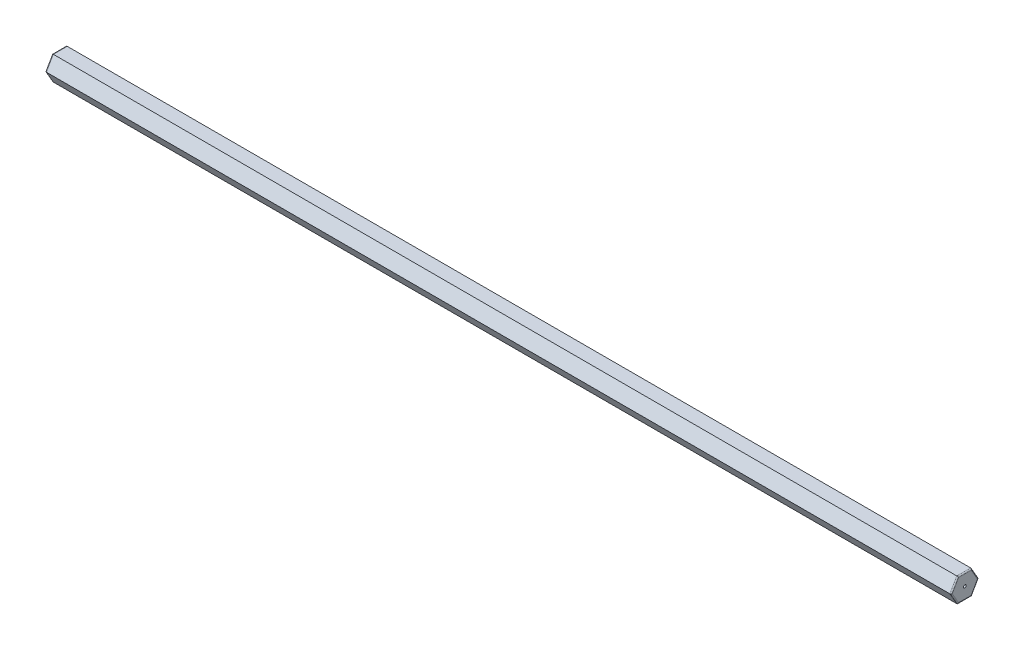
ISO-10303-21;
HEADER;
FILE_DESCRIPTION(('STEP AP214'),'2;1');
FILE_NAME('part.step','',(''),(''),'','','');
FILE_SCHEMA(('AUTOMOTIVE_DESIGN { 1 0 10303 214 1 1 1 1 }'));
ENDSEC;
DATA;
#1=APPLICATION_CONTEXT('core data for automotive mechanical design processes');
#2=APPLICATION_PROTOCOL_DEFINITION('international standard','automotive_design',2000,#1);
#3=PRODUCT_CONTEXT('',#1,'mechanical');
#4=PRODUCT('Part','Part','',(#3));
#5=PRODUCT_RELATED_PRODUCT_CATEGORY('part','',(#4));
#6=PRODUCT_DEFINITION_FORMATION('','',#4);
#7=PRODUCT_DEFINITION_CONTEXT('part definition',#1,'design');
#8=PRODUCT_DEFINITION('design','',#6,#7);
#9=PRODUCT_DEFINITION_SHAPE('','',#8);
#10=(LENGTH_UNIT() NAMED_UNIT(*) SI_UNIT(.MILLI.,.METRE.));
#11=(NAMED_UNIT(*) PLANE_ANGLE_UNIT() SI_UNIT($,.RADIAN.));
#12=(NAMED_UNIT(*) SI_UNIT($,.STERADIAN.) SOLID_ANGLE_UNIT());
#13=UNCERTAINTY_MEASURE_WITH_UNIT(LENGTH_MEASURE(1.E-05),#10,'distance_accuracy_value','');
#14=(GEOMETRIC_REPRESENTATION_CONTEXT(3) GLOBAL_UNCERTAINTY_ASSIGNED_CONTEXT((#13)) GLOBAL_UNIT_ASSIGNED_CONTEXT((#10,
#11,#12)) REPRESENTATION_CONTEXT('',''));
#15=CARTESIAN_POINT('',(0.,0.,0.));
#16=DIRECTION('',(0.,0.,1.));
#17=DIRECTION('',(1.,0.,0.));
#18=AXIS2_PLACEMENT_3D('',#15,#16,#17);
#19=CARTESIAN_POINT('',(-100.4824,-1.3335,-0.76989658396437));
#20=DIRECTION('',(0.,-0.5,-0.866025403784439));
#21=DIRECTION('',(0.,0.866025403784439,-0.5));
#22=AXIS2_PLACEMENT_3D('',#19,#20,#21);
#23=PLANE('',#22);
#24=DIRECTION('',(1.,0.,0.));
#25=VECTOR('',#24,1.);
#26=CARTESIAN_POINT('',(-100.4824,-1.3335,-0.76989658396437));
#27=LINE('',#26,#25);
#28=CARTESIAN_POINT('',(-100.3554,-1.3335,-0.76989658396437));
#29=VERTEX_POINT('',#28);
#30=CARTESIAN_POINT('',(-0.126999999999988,-1.3335,-0.76989658396437));
#31=VERTEX_POINT('',#30);
#32=EDGE_CURVE('E152',#29,#31,#27,.T.);
#33=ORIENTED_EDGE('',*,*,#32,.F.);
#34=DIRECTION('',(0.,0.866025403784439,-0.5));
#35=VECTOR('',#34,1.);
#36=CARTESIAN_POINT('',(-100.3554,0.,-1.53979316792873));
#37=LINE('',#36,#35);
#38=CARTESIAN_POINT('',(-100.3554,0.,-1.53979316792873));
#39=VERTEX_POINT('',#38);
#40=EDGE_CURVE('E184',#29,#39,#37,.T.);
#41=ORIENTED_EDGE('',*,*,#40,.T.);
#42=DIRECTION('',(1.,0.,0.));
#43=VECTOR('',#42,1.);
#44=CARTESIAN_POINT('',(-100.4824,0.,-1.53979316792873));
#45=LINE('',#44,#43);
#46=CARTESIAN_POINT('',(-0.126999999999988,0.,-1.53979316792873));
#47=VERTEX_POINT('',#46);
#48=EDGE_CURVE('E218',#39,#47,#45,.T.);
#49=ORIENTED_EDGE('',*,*,#48,.T.);
#50=DIRECTION('',(0.,0.866025403784439,-0.5));
#51=VECTOR('',#50,1.);
#52=CARTESIAN_POINT('',(-0.127000000000002,-1.3335,-0.76989658396437));
#53=LINE('',#52,#51);
#54=EDGE_CURVE('E182',#47,#31,#53,.F.);
#55=ORIENTED_EDGE('',*,*,#54,.T.);
#56=EDGE_LOOP('',(#33,#41,#49,#55));
#57=FACE_BOUND('',#56,.T.);
#58=ADVANCED_FACE('F37',(#57),#23,.T.);
#59=CARTESIAN_POINT('',(-100.4824,-1.3335,0.769896583964367));
#60=DIRECTION('',(0.,-1.,0.));
#61=DIRECTION('',(0.,0.,-1.));
#62=AXIS2_PLACEMENT_3D('',#59,#60,#61);
#63=PLANE('',#62);
#64=DIRECTION('',(1.,0.,0.));
#65=VECTOR('',#64,1.);
#66=CARTESIAN_POINT('',(-100.4824,-1.3335,0.769896583964367));
#67=LINE('',#66,#65);
#68=CARTESIAN_POINT('',(-100.3554,-1.3335,0.769896583964367));
#69=VERTEX_POINT('',#68);
#70=CARTESIAN_POINT('',(-0.126999999999988,-1.3335,0.769896583964367));
#71=VERTEX_POINT('',#70);
#72=EDGE_CURVE('E133',#69,#71,#67,.T.);
#73=ORIENTED_EDGE('',*,*,#72,.F.);
#74=DIRECTION('',(0.,0.,-1.));
#75=VECTOR('',#74,1.);
#76=CARTESIAN_POINT('',(-100.3554,-1.3335,-0.76989658396437));
#77=LINE('',#76,#75);
#78=EDGE_CURVE('E148',#69,#29,#77,.T.);
#79=ORIENTED_EDGE('',*,*,#78,.T.);
#80=ORIENTED_EDGE('',*,*,#32,.T.);
#81=DIRECTION('',(0.,0.,-1.));
#82=VECTOR('',#81,1.);
#83=CARTESIAN_POINT('',(-0.127000000000002,-1.3335,0.769896583964367));
#84=LINE('',#83,#82);
#85=EDGE_CURVE('E151',#31,#71,#84,.F.);
#86=ORIENTED_EDGE('',*,*,#85,.T.);
#87=EDGE_LOOP('',(#73,#79,#80,#86));
#88=FACE_BOUND('',#87,.T.);
#89=ADVANCED_FACE('F145',(#88),#63,.T.);
#90=CARTESIAN_POINT('',(-100.4824,0.,1.53979316792873));
#91=DIRECTION('',(0.,-0.5,0.866025403784439));
#92=DIRECTION('',(0.,-0.866025403784439,-0.5));
#93=AXIS2_PLACEMENT_3D('',#90,#91,#92);
#94=PLANE('',#93);
#95=DIRECTION('',(1.,0.,0.));
#96=VECTOR('',#95,1.);
#97=CARTESIAN_POINT('',(-100.4824,0.,1.53979316792873));
#98=LINE('',#97,#96);
#99=CARTESIAN_POINT('',(-100.3554,0.,1.53979316792873));
#100=VERTEX_POINT('',#99);
#101=CARTESIAN_POINT('',(-0.126999999999988,0.,1.53979316792873));
#102=VERTEX_POINT('',#101);
#103=EDGE_CURVE('E135',#100,#102,#98,.T.);
#104=ORIENTED_EDGE('',*,*,#103,.F.);
#105=DIRECTION('',(0.,-0.866025403784439,-0.5));
#106=VECTOR('',#105,1.);
#107=CARTESIAN_POINT('',(-100.3554,-1.3335,0.769896583964367));
#108=LINE('',#107,#106);
#109=EDGE_CURVE('E129',#100,#69,#108,.T.);
#110=ORIENTED_EDGE('',*,*,#109,.T.);
#111=ORIENTED_EDGE('',*,*,#72,.T.);
#112=DIRECTION('',(0.,-0.866025403784439,-0.5));
#113=VECTOR('',#112,1.);
#114=CARTESIAN_POINT('',(-0.127000000000002,0.,1.53979316792873));
#115=LINE('',#114,#113);
#116=EDGE_CURVE('E141',#71,#102,#115,.F.);
#117=ORIENTED_EDGE('',*,*,#116,.T.);
#118=EDGE_LOOP('',(#104,#110,#111,#117));
#119=FACE_BOUND('',#118,.T.);
#120=ADVANCED_FACE('F131',(#119),#94,.T.);
#121=CARTESIAN_POINT('',(-100.4824,1.3335,0.769896583964367));
#122=DIRECTION('',(0.,0.5,0.866025403784438));
#123=DIRECTION('',(0.,-0.866025403784439,0.5));
#124=AXIS2_PLACEMENT_3D('',#121,#122,#123);
#125=PLANE('',#124);
#126=DIRECTION('',(1.,0.,0.));
#127=VECTOR('',#126,1.);
#128=CARTESIAN_POINT('',(-100.4824,1.3335,0.769896583964367));
#129=LINE('',#128,#127);
#130=CARTESIAN_POINT('',(-100.3554,1.3335,0.769896583964367));
#131=VERTEX_POINT('',#130);
#132=CARTESIAN_POINT('',(-0.126999999999988,1.3335,0.769896583964367));
#133=VERTEX_POINT('',#132);
#134=EDGE_CURVE('E252',#131,#133,#129,.T.);
#135=ORIENTED_EDGE('',*,*,#134,.F.);
#136=DIRECTION('',(0.,-0.866025403784439,0.5));
#137=VECTOR('',#136,1.);
#138=CARTESIAN_POINT('',(-100.3554,0.,1.53979316792873));
#139=LINE('',#138,#137);
#140=EDGE_CURVE('E196',#131,#100,#139,.T.);
#141=ORIENTED_EDGE('',*,*,#140,.T.);
#142=ORIENTED_EDGE('',*,*,#103,.T.);
#143=DIRECTION('',(0.,-0.866025403784439,0.5));
#144=VECTOR('',#143,1.);
#145=CARTESIAN_POINT('',(-0.127000000000002,1.3335,0.769896583964367));
#146=LINE('',#145,#144);
#147=EDGE_CURVE('E194',#102,#133,#146,.F.);
#148=ORIENTED_EDGE('',*,*,#147,.T.);
#149=EDGE_LOOP('',(#135,#141,#142,#148));
#150=FACE_BOUND('',#149,.T.);
#151=ADVANCED_FACE('F334',(#150),#125,.T.);
#152=CARTESIAN_POINT('',(-100.4824,1.3335,-0.769896583964363));
#153=DIRECTION('',(0.,1.,0.));
#154=DIRECTION('',(0.,0.,1.));
#155=AXIS2_PLACEMENT_3D('',#152,#153,#154);
#156=PLANE('',#155);
#157=DIRECTION('',(1.,0.,0.));
#158=VECTOR('',#157,1.);
#159=CARTESIAN_POINT('',(-100.4824,1.3335,-0.769896583964363));
#160=LINE('',#159,#158);
#161=CARTESIAN_POINT('',(-100.3554,1.3335,-0.769896583964363));
#162=VERTEX_POINT('',#161);
#163=CARTESIAN_POINT('',(-0.126999999999988,1.3335,-0.769896583964363));
#164=VERTEX_POINT('',#163);
#165=EDGE_CURVE('E250',#162,#164,#160,.T.);
#166=ORIENTED_EDGE('',*,*,#165,.F.);
#167=DIRECTION('',(0.,0.,1.));
#168=VECTOR('',#167,1.);
#169=CARTESIAN_POINT('',(-100.3554,1.3335,0.769896583964367));
#170=LINE('',#169,#168);
#171=EDGE_CURVE('E192',#162,#131,#170,.T.);
#172=ORIENTED_EDGE('',*,*,#171,.T.);
#173=ORIENTED_EDGE('',*,*,#134,.T.);
#174=DIRECTION('',(0.,0.,1.));
#175=VECTOR('',#174,1.);
#176=CARTESIAN_POINT('',(-0.127000000000002,1.3335,-0.769896583964363));
#177=LINE('',#176,#175);
#178=EDGE_CURVE('E190',#133,#164,#177,.F.);
#179=ORIENTED_EDGE('',*,*,#178,.T.);
#180=EDGE_LOOP('',(#166,#172,#173,#179));
#181=FACE_BOUND('',#180,.T.);
#182=ADVANCED_FACE('F336',(#181),#156,.T.);
#183=CARTESIAN_POINT('',(-100.4824,0.,-1.53979316792873));
#184=DIRECTION('',(0.,0.500000000000001,-0.866025403784438));
#185=DIRECTION('',(0.,0.866025403784438,0.500000000000001));
#186=AXIS2_PLACEMENT_3D('',#183,#184,#185);
#187=PLANE('',#186);
#188=ORIENTED_EDGE('',*,*,#48,.F.);
#189=DIRECTION('',(0.,0.866025403784438,0.500000000000001));
#190=VECTOR('',#189,1.);
#191=CARTESIAN_POINT('',(-100.3554,1.3335,-0.769896583964363));
#192=LINE('',#191,#190);
#193=EDGE_CURVE('E188',#39,#162,#192,.T.);
#194=ORIENTED_EDGE('',*,*,#193,.T.);
#195=ORIENTED_EDGE('',*,*,#165,.T.);
#196=DIRECTION('',(0.,0.866025403784438,0.500000000000001));
#197=VECTOR('',#196,1.);
#198=CARTESIAN_POINT('',(-0.127000000000002,0.,-1.53979316792873));
#199=LINE('',#198,#197);
#200=EDGE_CURVE('E186',#164,#47,#199,.F.);
#201=ORIENTED_EDGE('',*,*,#200,.T.);
#202=EDGE_LOOP('',(#188,#194,#195,#201));
#203=FACE_BOUND('',#202,.T.);
#204=ADVANCED_FACE('F247',(#203),#187,.T.);
#205=CARTESIAN_POINT('',(-100.4824,0.,-1.53979316792873));
#206=DIRECTION('',(1.,0.,0.));
#207=DIRECTION('',(0.,0.,-1.));
#208=AXIS2_PLACEMENT_3D('',#205,#206,#207);
#209=PLANE('',#208);
#210=DIRECTION('',(0.,0.866025403784439,-0.5));
#211=VECTOR('',#210,1.);
#212=CARTESIAN_POINT('',(-100.4824,-1.27,-0.659911357683747));
#213=LINE('',#212,#211);
#214=CARTESIAN_POINT('',(-100.4824,0.,-1.39314619955457));
#215=VERTEX_POINT('',#214);
#216=CARTESIAN_POINT('',(-100.4824,-1.2065,-0.696573099777288));
#217=VERTEX_POINT('',#216);
#218=EDGE_CURVE('E178',#215,#217,#213,.F.);
#219=ORIENTED_EDGE('',*,*,#218,.T.);
#220=DIRECTION('',(0.,0.,-1.));
#221=VECTOR('',#220,1.);
#222=CARTESIAN_POINT('',(-100.4824,-1.2065,0.769896583964367));
#223=LINE('',#222,#221);
#224=CARTESIAN_POINT('',(-100.4824,-1.2065,0.696573099777285));
#225=VERTEX_POINT('',#224);
#226=EDGE_CURVE('E180',#217,#225,#223,.F.);
#227=ORIENTED_EDGE('',*,*,#226,.T.);
#228=DIRECTION('',(0.,-0.866025403784439,-0.5));
#229=VECTOR('',#228,1.);
#230=CARTESIAN_POINT('',(-100.4824,0.0634999999999995,1.42980794164811));
#231=LINE('',#230,#229);
#232=CARTESIAN_POINT('',(-100.4824,0.,1.39314619955457));
#233=VERTEX_POINT('',#232);
#234=EDGE_CURVE('E157',#225,#233,#231,.F.);
#235=ORIENTED_EDGE('',*,*,#234,.T.);
#236=DIRECTION('',(0.,-0.866025403784439,0.5));
#237=VECTOR('',#236,1.);
#238=CARTESIAN_POINT('',(-100.4824,1.27,0.659911357683743));
#239=LINE('',#238,#237);
#240=CARTESIAN_POINT('',(-100.4824,1.2065,0.696573099777284));
#241=VERTEX_POINT('',#240);
#242=EDGE_CURVE('E168',#233,#241,#239,.F.);
#243=ORIENTED_EDGE('',*,*,#242,.T.);
#244=DIRECTION('',(0.,0.,1.));
#245=VECTOR('',#244,1.);
#246=CARTESIAN_POINT('',(-100.4824,1.2065,-0.769896583964363));
#247=LINE('',#246,#245);
#248=CARTESIAN_POINT('',(-100.4824,1.2065,-0.696573099777281));
#249=VERTEX_POINT('',#248);
#250=EDGE_CURVE('E174',#241,#249,#247,.F.);
#251=ORIENTED_EDGE('',*,*,#250,.T.);
#252=DIRECTION('',(0.,0.866025403784438,0.500000000000001));
#253=VECTOR('',#252,1.);
#254=CARTESIAN_POINT('',(-100.4824,-0.0635000000000053,-1.42980794164811));
#255=LINE('',#254,#253);
#256=EDGE_CURVE('E176',#249,#215,#255,.F.);
#257=ORIENTED_EDGE('',*,*,#256,.T.);
#258=EDGE_LOOP('',(#219,#227,#235,#243,#251,#257));
#259=FACE_BOUND('',#258,.T.);
#260=ADVANCED_FACE('F277',(#259),#209,.F.);
#261=CARTESIAN_POINT('',(0.,0.,-1.53979316792873));
#262=DIRECTION('',(1.,0.,0.));
#263=DIRECTION('',(0.,0.,-1.));
#264=AXIS2_PLACEMENT_3D('',#261,#262,#263);
#265=PLANE('',#264);
#266=CARTESIAN_POINT('',(0.,0.,0.));
#267=DIRECTION('',(1.,0.,0.));
#268=DIRECTION('',(0.,0.,-1.));
#269=AXIS2_PLACEMENT_3D('',#266,#267,#268);
#270=CIRCLE('',#269,0.153628898890699);
#271=CARTESIAN_POINT('',(0.,0.,-0.153628898890699));
#272=VERTEX_POINT('',#271);
#273=EDGE_CURVE('E259',#272,#272,#270,.T.);
#274=ORIENTED_EDGE('',*,*,#273,.F.);
#275=EDGE_LOOP('',(#274));
#276=FACE_BOUND('',#275,.T.);
#277=DIRECTION('',(0.,-0.866025403784439,0.5));
#278=VECTOR('',#277,1.);
#279=CARTESIAN_POINT('',(0.,1.27,0.659911357683745));
#280=LINE('',#279,#278);
#281=CARTESIAN_POINT('',(0.,1.2065,0.696573099777285));
#282=VERTEX_POINT('',#281);
#283=CARTESIAN_POINT('',(0.,0.,1.39314619955457));
#284=VERTEX_POINT('',#283);
#285=EDGE_CURVE('E140',#282,#284,#280,.T.);
#286=ORIENTED_EDGE('',*,*,#285,.T.);
#287=DIRECTION('',(0.,-0.866025403784439,-0.5));
#288=VECTOR('',#287,1.);
#289=CARTESIAN_POINT('',(0.,-1.27000000000001,0.659911357683741));
#290=LINE('',#289,#288);
#291=CARTESIAN_POINT('',(0.,-1.2065,0.696573099777285));
#292=VERTEX_POINT('',#291);
#293=EDGE_CURVE('E11',#284,#292,#290,.T.);
#294=ORIENTED_EDGE('',*,*,#293,.T.);
#295=DIRECTION('',(0.,0.,-1.));
#296=VECTOR('',#295,1.);
#297=CARTESIAN_POINT('',(0.,-1.2065,-1.53979316792873));
#298=LINE('',#297,#296);
#299=CARTESIAN_POINT('',(0.,-1.2065,-0.696573099777287));
#300=VERTEX_POINT('',#299);
#301=EDGE_CURVE('E46',#292,#300,#298,.T.);
#302=ORIENTED_EDGE('',*,*,#301,.T.);
#303=DIRECTION('',(0.,0.866025403784439,-0.5));
#304=VECTOR('',#303,1.);
#305=CARTESIAN_POINT('',(0.,0.0634999999999952,-1.42980794164811));
#306=LINE('',#305,#304);
#307=CARTESIAN_POINT('',(0.,0.,-1.39314619955457));
#308=VERTEX_POINT('',#307);
#309=EDGE_CURVE('E204',#300,#308,#306,.T.);
#310=ORIENTED_EDGE('',*,*,#309,.T.);
#311=DIRECTION('',(0.,0.866025403784438,0.500000000000001));
#312=VECTOR('',#311,1.);
#313=CARTESIAN_POINT('',(0.,-0.0635000000000048,-1.42980794164811));
#314=LINE('',#313,#312);
#315=CARTESIAN_POINT('',(0.,1.2065,-0.696573099777281));
#316=VERTEX_POINT('',#315);
#317=EDGE_CURVE('E202',#308,#316,#314,.T.);
#318=ORIENTED_EDGE('',*,*,#317,.T.);
#319=DIRECTION('',(0.,0.,1.));
#320=VECTOR('',#319,1.);
#321=CARTESIAN_POINT('',(0.,1.2065,-1.53979316792873));
#322=LINE('',#321,#320);
#323=EDGE_CURVE('E200',#316,#282,#322,.T.);
#324=ORIENTED_EDGE('',*,*,#323,.T.);
#325=EDGE_LOOP('',(#286,#294,#302,#310,#318,#324));
#326=FACE_BOUND('',#325,.T.);
#327=ADVANCED_FACE('F274',(#276,#326),#265,.T.);
#328=CARTESIAN_POINT('',(-100.3554,1.2065,-0.769896583964363));
#329=DIRECTION('',(0.,0.,-1.));
#330=DIRECTION('',(-1.,0.,0.));
#331=AXIS2_PLACEMENT_3D('',#328,#329,#330);
#332=CYLINDRICAL_SURFACE('',#331,0.127);
#333=CARTESIAN_POINT('',(-100.3554,1.2065,-0.696573099777281));
#334=DIRECTION('',(0.,-0.5,-0.866025403784439));
#335=DIRECTION('',(0.,0.866025403784439,-0.5));
#336=AXIS2_PLACEMENT_3D('',#333,#334,#335);
#337=ELLIPSE('',#336,0.146646968374165,0.127);
#338=EDGE_CURVE('E212',#249,#162,#337,.T.);
#339=ORIENTED_EDGE('',*,*,#338,.F.);
#340=ORIENTED_EDGE('',*,*,#250,.F.);
#341=CARTESIAN_POINT('',(-100.3554,1.2065,0.696573099777284));
#342=DIRECTION('',(0.,0.5,-0.866025403784439));
#343=DIRECTION('',(0.,0.866025403784439,0.5));
#344=AXIS2_PLACEMENT_3D('',#341,#342,#343);
#345=ELLIPSE('',#344,0.146646968374165,0.127);
#346=EDGE_CURVE('E215',#131,#241,#345,.F.);
#347=ORIENTED_EDGE('',*,*,#346,.F.);
#348=ORIENTED_EDGE('',*,*,#171,.F.);
#349=EDGE_LOOP('',(#339,#340,#347,#348));
#350=FACE_BOUND('',#349,.T.);
#351=ADVANCED_FACE('F276',(#350),#332,.T.);
#352=CARTESIAN_POINT('',(-100.3554,1.27,0.659911357683743));
#353=DIRECTION('',(0.,0.866025403784439,-0.5));
#354=DIRECTION('',(0.,0.5,0.866025403784438));
#355=AXIS2_PLACEMENT_3D('',#352,#353,#354);
#356=CYLINDRICAL_SURFACE('',#355,0.127);
#357=ORIENTED_EDGE('',*,*,#346,.T.);
#358=ORIENTED_EDGE('',*,*,#242,.F.);
#359=CARTESIAN_POINT('',(-100.3554,0.,1.39314619955457));
#360=DIRECTION('',(0.,1.,0.));
#361=DIRECTION('',(0.,0.,1.));
#362=AXIS2_PLACEMENT_3D('',#359,#360,#361);
#363=ELLIPSE('',#362,0.146646968374165,0.127);
#364=EDGE_CURVE('E210',#100,#233,#363,.F.);
#365=ORIENTED_EDGE('',*,*,#364,.F.);
#366=ORIENTED_EDGE('',*,*,#140,.F.);
#367=EDGE_LOOP('',(#357,#358,#365,#366));
#368=FACE_BOUND('',#367,.T.);
#369=ADVANCED_FACE('F313',(#368),#356,.T.);
#370=CARTESIAN_POINT('',(-100.3554,-0.0635000000000052,-1.42980794164811));
#371=DIRECTION('',(0.,-0.866025403784438,-0.500000000000001));
#372=DIRECTION('',(0.,0.500000000000001,-0.866025403784438));
#373=AXIS2_PLACEMENT_3D('',#370,#371,#372);
#374=CYLINDRICAL_SURFACE('',#373,0.127);
#375=ORIENTED_EDGE('',*,*,#338,.T.);
#376=ORIENTED_EDGE('',*,*,#193,.F.);
#377=CARTESIAN_POINT('',(-100.3554,0.,-1.39314619955457));
#378=DIRECTION('',(0.,-1.,0.));
#379=DIRECTION('',(0.,0.,-1.));
#380=AXIS2_PLACEMENT_3D('',#377,#378,#379);
#381=ELLIPSE('',#380,0.146646968374165,0.127);
#382=EDGE_CURVE('E161',#215,#39,#381,.T.);
#383=ORIENTED_EDGE('',*,*,#382,.F.);
#384=ORIENTED_EDGE('',*,*,#256,.F.);
#385=EDGE_LOOP('',(#375,#376,#383,#384));
#386=FACE_BOUND('',#385,.T.);
#387=ADVANCED_FACE('F310',(#386),#374,.T.);
#388=CARTESIAN_POINT('',(-100.3554,0.0634999999999995,1.42980794164811));
#389=DIRECTION('',(0.,0.866025403784439,0.5));
#390=DIRECTION('',(0.,-0.5,0.866025403784439));
#391=AXIS2_PLACEMENT_3D('',#388,#389,#390);
#392=CYLINDRICAL_SURFACE('',#391,0.127);
#393=ORIENTED_EDGE('',*,*,#364,.T.);
#394=ORIENTED_EDGE('',*,*,#234,.F.);
#395=CARTESIAN_POINT('',(-100.3554,-1.2065,0.696573099777285));
#396=DIRECTION('',(0.,0.5,0.866025403784439));
#397=DIRECTION('',(0.,0.866025403784439,-0.5));
#398=AXIS2_PLACEMENT_3D('',#395,#396,#397);
#399=ELLIPSE('',#398,0.146646968374165,0.127);
#400=EDGE_CURVE('E155',#69,#225,#399,.F.);
#401=ORIENTED_EDGE('',*,*,#400,.F.);
#402=ORIENTED_EDGE('',*,*,#109,.F.);
#403=EDGE_LOOP('',(#393,#394,#401,#402));
#404=FACE_BOUND('',#403,.T.);
#405=ADVANCED_FACE('F156',(#404),#392,.T.);
#406=CARTESIAN_POINT('',(-100.3554,-1.27,-0.659911357683747));
#407=DIRECTION('',(0.,-0.866025403784439,0.5));
#408=DIRECTION('',(0.,-0.5,-0.866025403784439));
#409=AXIS2_PLACEMENT_3D('',#406,#407,#408);
#410=CYLINDRICAL_SURFACE('',#409,0.127);
#411=ORIENTED_EDGE('',*,*,#382,.T.);
#412=ORIENTED_EDGE('',*,*,#40,.F.);
#413=CARTESIAN_POINT('',(-100.3554,-1.2065,-0.696573099777288));
#414=DIRECTION('',(0.,-0.5,0.866025403784439));
#415=DIRECTION('',(0.,-0.866025403784439,-0.5));
#416=AXIS2_PLACEMENT_3D('',#413,#414,#415);
#417=ELLIPSE('',#416,0.146646968374165,0.127);
#418=EDGE_CURVE('E162',#217,#29,#417,.T.);
#419=ORIENTED_EDGE('',*,*,#418,.F.);
#420=ORIENTED_EDGE('',*,*,#218,.F.);
#421=EDGE_LOOP('',(#411,#412,#419,#420));
#422=FACE_BOUND('',#421,.T.);
#423=ADVANCED_FACE('F304',(#422),#410,.T.);
#424=CARTESIAN_POINT('',(-100.3554,-1.2065,0.769896583964367));
#425=DIRECTION('',(0.,0.,1.));
#426=DIRECTION('',(0.,-1.,0.));
#427=AXIS2_PLACEMENT_3D('',#424,#425,#426);
#428=CYLINDRICAL_SURFACE('',#427,0.127);
#429=ORIENTED_EDGE('',*,*,#400,.T.);
#430=ORIENTED_EDGE('',*,*,#226,.F.);
#431=ORIENTED_EDGE('',*,*,#418,.T.);
#432=ORIENTED_EDGE('',*,*,#78,.F.);
#433=EDGE_LOOP('',(#429,#430,#431,#432));
#434=FACE_BOUND('',#433,.T.);
#435=ADVANCED_FACE('F164',(#434),#428,.T.);
#436=CARTESIAN_POINT('',(-0.127,-0.0635000000000048,-1.42980794164811));
#437=DIRECTION('',(0.,0.866025403784438,0.500000000000001));
#438=DIRECTION('',(0.,-0.500000000000001,0.866025403784438));
#439=AXIS2_PLACEMENT_3D('',#436,#437,#438);
#440=CYLINDRICAL_SURFACE('',#439,0.127);
#441=CARTESIAN_POINT('',(-0.127,0.,-1.39314619955457));
#442=DIRECTION('',(0.,1.,0.));
#443=DIRECTION('',(0.,0.,1.));
#444=AXIS2_PLACEMENT_3D('',#441,#442,#443);
#445=ELLIPSE('',#444,0.146646968374165,0.127);
#446=EDGE_CURVE('E228',#47,#308,#445,.F.);
#447=ORIENTED_EDGE('',*,*,#446,.F.);
#448=ORIENTED_EDGE('',*,*,#200,.F.);
#449=CARTESIAN_POINT('',(-0.127,1.2065,-0.696573099777281));
#450=DIRECTION('',(0.,0.5,0.866025403784439));
#451=DIRECTION('',(0.,-0.866025403784439,0.5));
#452=AXIS2_PLACEMENT_3D('',#449,#450,#451);
#453=ELLIPSE('',#452,0.146646968374165,0.127);
#454=EDGE_CURVE('E41',#316,#164,#453,.T.);
#455=ORIENTED_EDGE('',*,*,#454,.F.);
#456=ORIENTED_EDGE('',*,*,#317,.F.);
#457=EDGE_LOOP('',(#447,#448,#455,#456));
#458=FACE_BOUND('',#457,.T.);
#459=ADVANCED_FACE('F39',(#458),#440,.T.);
#460=CARTESIAN_POINT('',(-0.127,1.2065,-1.53979316792873));
#461=DIRECTION('',(0.,0.,1.));
#462=DIRECTION('',(1.,0.,0.));
#463=AXIS2_PLACEMENT_3D('',#460,#461,#462);
#464=CYLINDRICAL_SURFACE('',#463,0.127);
#465=ORIENTED_EDGE('',*,*,#454,.T.);
#466=ORIENTED_EDGE('',*,*,#178,.F.);
#467=CARTESIAN_POINT('',(-0.127,1.2065,0.696573099777285));
#468=DIRECTION('',(0.,-0.5,0.866025403784439));
#469=DIRECTION('',(0.,-0.866025403784439,-0.5));
#470=AXIS2_PLACEMENT_3D('',#467,#468,#469);
#471=ELLIPSE('',#470,0.146646968374165,0.127);
#472=EDGE_CURVE('E226',#282,#133,#471,.T.);
#473=ORIENTED_EDGE('',*,*,#472,.F.);
#474=ORIENTED_EDGE('',*,*,#323,.F.);
#475=EDGE_LOOP('',(#465,#466,#473,#474));
#476=FACE_BOUND('',#475,.T.);
#477=ADVANCED_FACE('F238',(#476),#464,.T.);
#478=CARTESIAN_POINT('',(-0.127,0.0634999999999952,-1.42980794164811));
#479=DIRECTION('',(0.,0.866025403784439,-0.5));
#480=DIRECTION('',(0.,0.5,0.866025403784439));
#481=AXIS2_PLACEMENT_3D('',#478,#479,#480);
#482=CYLINDRICAL_SURFACE('',#481,0.127);
#483=ORIENTED_EDGE('',*,*,#446,.T.);
#484=ORIENTED_EDGE('',*,*,#309,.F.);
#485=CARTESIAN_POINT('',(-0.127,-1.2065,-0.696573099777288));
#486=DIRECTION('',(0.,0.5,-0.866025403784439));
#487=DIRECTION('',(0.,0.866025403784439,0.5));
#488=AXIS2_PLACEMENT_3D('',#485,#486,#487);
#489=ELLIPSE('',#488,0.146646968374165,0.127);
#490=EDGE_CURVE('E223',#31,#300,#489,.F.);
#491=ORIENTED_EDGE('',*,*,#490,.F.);
#492=ORIENTED_EDGE('',*,*,#54,.F.);
#493=EDGE_LOOP('',(#483,#484,#491,#492));
#494=FACE_BOUND('',#493,.T.);
#495=ADVANCED_FACE('F396',(#494),#482,.T.);
#496=CARTESIAN_POINT('',(-0.127,1.27,0.659911357683745));
#497=DIRECTION('',(0.,-0.866025403784439,0.5));
#498=DIRECTION('',(0.,-0.5,-0.866025403784438));
#499=AXIS2_PLACEMENT_3D('',#496,#497,#498);
#500=CYLINDRICAL_SURFACE('',#499,0.127);
#501=ORIENTED_EDGE('',*,*,#472,.T.);
#502=ORIENTED_EDGE('',*,*,#147,.F.);
#503=CARTESIAN_POINT('',(-0.127,0.,1.39314619955457));
#504=DIRECTION('',(0.,-1.,0.));
#505=DIRECTION('',(0.,0.,1.));
#506=AXIS2_PLACEMENT_3D('',#503,#504,#505);
#507=ELLIPSE('',#506,0.146646968374165,0.127);
#508=EDGE_CURVE('E220',#284,#102,#507,.T.);
#509=ORIENTED_EDGE('',*,*,#508,.F.);
#510=ORIENTED_EDGE('',*,*,#285,.F.);
#511=EDGE_LOOP('',(#501,#502,#509,#510));
#512=FACE_BOUND('',#511,.T.);
#513=ADVANCED_FACE('F283',(#512),#500,.T.);
#514=CARTESIAN_POINT('',(-0.127,-1.2065,-1.53979316792873));
#515=DIRECTION('',(0.,0.,-1.));
#516=DIRECTION('',(0.,1.,0.));
#517=AXIS2_PLACEMENT_3D('',#514,#515,#516);
#518=CYLINDRICAL_SURFACE('',#517,0.127);
#519=ORIENTED_EDGE('',*,*,#490,.T.);
#520=ORIENTED_EDGE('',*,*,#301,.F.);
#521=CARTESIAN_POINT('',(-0.127,-1.2065,0.696573099777285));
#522=DIRECTION('',(0.,-0.5,-0.866025403784439));
#523=DIRECTION('',(0.,0.866025403784439,-0.5));
#524=AXIS2_PLACEMENT_3D('',#521,#522,#523);
#525=ELLIPSE('',#524,0.146646968374165,0.127);
#526=EDGE_CURVE('E54',#71,#292,#525,.F.);
#527=ORIENTED_EDGE('',*,*,#526,.F.);
#528=ORIENTED_EDGE('',*,*,#85,.F.);
#529=EDGE_LOOP('',(#519,#520,#527,#528));
#530=FACE_BOUND('',#529,.T.);
#531=ADVANCED_FACE('F285',(#530),#518,.T.);
#532=CARTESIAN_POINT('',(-0.127,-1.27000000000001,0.659911357683741));
#533=DIRECTION('',(0.,-0.866025403784439,-0.5));
#534=DIRECTION('',(0.,0.5,-0.866025403784439));
#535=AXIS2_PLACEMENT_3D('',#532,#533,#534);
#536=CYLINDRICAL_SURFACE('',#535,0.127);
#537=ORIENTED_EDGE('',*,*,#508,.T.);
#538=ORIENTED_EDGE('',*,*,#116,.F.);
#539=ORIENTED_EDGE('',*,*,#526,.T.);
#540=ORIENTED_EDGE('',*,*,#293,.F.);
#541=EDGE_LOOP('',(#537,#538,#539,#540));
#542=FACE_BOUND('',#541,.T.);
#543=ADVANCED_FACE('F270',(#542),#536,.T.);
#544=CARTESIAN_POINT('',(-0.254,0.,0.));
#545=DIRECTION('',(1.,0.,0.));
#546=DIRECTION('',(0.,0.,-1.));
#547=AXIS2_PLACEMENT_3D('',#544,#545,#546);
#548=CYLINDRICAL_SURFACE('',#547,0.153628898890699);
#549=CARTESIAN_POINT('',(-0.254,0.,0.));
#550=DIRECTION('',(1.,0.,0.));
#551=DIRECTION('',(0.,0.,-1.));
#552=AXIS2_PLACEMENT_3D('',#549,#550,#551);
#553=CIRCLE('',#552,0.153628898890699);
#554=CARTESIAN_POINT('',(-0.254,0.,-0.153628898890699));
#555=VERTEX_POINT('',#554);
#556=EDGE_CURVE('E221',#555,#555,#553,.T.);
#557=ORIENTED_EDGE('',*,*,#556,.F.);
#558=EDGE_LOOP('',(#557));
#559=FACE_BOUND('',#558,.T.);
#560=ORIENTED_EDGE('',*,*,#273,.T.);
#561=EDGE_LOOP('',(#560));
#562=FACE_BOUND('',#561,.T.);
#563=ADVANCED_FACE('F267',(#559,#562),#548,.F.);
#564=CARTESIAN_POINT('',(-0.254,0.,0.));
#565=DIRECTION('',(1.,0.,0.));
#566=DIRECTION('',(0.,0.,-1.));
#567=AXIS2_PLACEMENT_3D('',#564,#565,#566);
#568=PLANE('',#567);
#569=ORIENTED_EDGE('',*,*,#556,.T.);
#570=EDGE_LOOP('',(#569));
#571=FACE_BOUND('',#570,.T.);
#572=ADVANCED_FACE('F265',(#571),#568,.T.);
#573=CLOSED_SHELL('',(#58,#89,#120,#151,#182,#204,#260,#327,#351,#369,#387,#405,#423,#435,#459,
#477,#495,#513,#531,#543,#563,#572));
#574=MANIFOLD_SOLID_BREP('B2',#573);
#575=ADVANCED_BREP_SHAPE_REPRESENTATION('',(#18,#574),#14);
#576=SHAPE_DEFINITION_REPRESENTATION(#9,#575);
ENDSEC;
END-ISO-10303-21;
